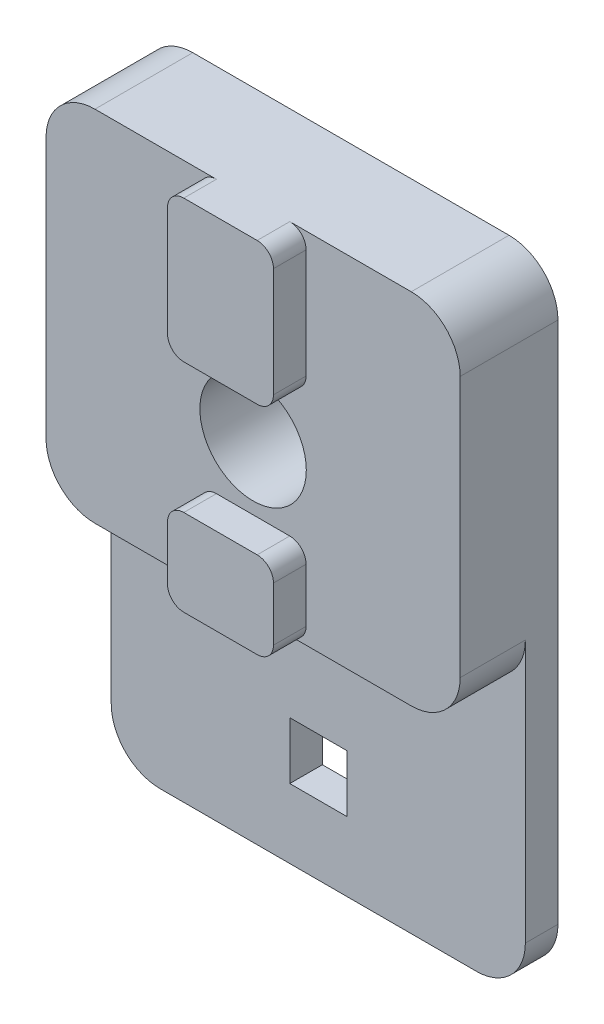
ISO-10303-21;
HEADER;
FILE_DESCRIPTION(('STEP AP214'),'2;1');
FILE_NAME('part.step','',(''),(''),'','','');
FILE_SCHEMA(('AUTOMOTIVE_DESIGN { 1 0 10303 214 1 1 1 1 }'));
ENDSEC;
DATA;
#1=APPLICATION_CONTEXT('core data for automotive mechanical design processes');
#2=APPLICATION_PROTOCOL_DEFINITION('international standard','automotive_design',2000,#1);
#3=PRODUCT_CONTEXT('',#1,'mechanical');
#4=PRODUCT('Part','Part','',(#3));
#5=PRODUCT_RELATED_PRODUCT_CATEGORY('part','',(#4));
#6=PRODUCT_DEFINITION_FORMATION('','',#4);
#7=PRODUCT_DEFINITION_CONTEXT('part definition',#1,'design');
#8=PRODUCT_DEFINITION('design','',#6,#7);
#9=PRODUCT_DEFINITION_SHAPE('','',#8);
#10=(LENGTH_UNIT() NAMED_UNIT(*) SI_UNIT(.MILLI.,.METRE.));
#11=(NAMED_UNIT(*) PLANE_ANGLE_UNIT() SI_UNIT($,.RADIAN.));
#12=(NAMED_UNIT(*) SI_UNIT($,.STERADIAN.) SOLID_ANGLE_UNIT());
#13=UNCERTAINTY_MEASURE_WITH_UNIT(LENGTH_MEASURE(1.E-05),#10,'distance_accuracy_value','');
#14=(GEOMETRIC_REPRESENTATION_CONTEXT(3) GLOBAL_UNCERTAINTY_ASSIGNED_CONTEXT((#13)) GLOBAL_UNIT_ASSIGNED_CONTEXT((#10,
#11,#12)) REPRESENTATION_CONTEXT('',''));
#15=CARTESIAN_POINT('',(0.,0.,0.));
#16=DIRECTION('',(0.,0.,1.));
#17=DIRECTION('',(1.,0.,0.));
#18=AXIS2_PLACEMENT_3D('',#15,#16,#17);
#19=CARTESIAN_POINT('',(0.,0.,6.));
#20=DIRECTION('',(0.,0.,1.));
#21=DIRECTION('',(1.,0.,0.));
#22=AXIS2_PLACEMENT_3D('',#19,#20,#21);
#23=PLANE('',#22);
#24=CARTESIAN_POINT('',(0.,19.4,6.));
#25=DIRECTION('',(0.,0.,1.));
#26=DIRECTION('',(1.,0.,0.));
#27=AXIS2_PLACEMENT_3D('',#24,#25,#26);
#28=CIRCLE('',#27,3.2639);
#29=CARTESIAN_POINT('',(3.2639,19.4,6.));
#30=VERTEX_POINT('',#29);
#31=EDGE_CURVE('E479',#30,#30,#28,.T.);
#32=ORIENTED_EDGE('',*,*,#31,.F.);
#33=EDGE_LOOP('',(#32));
#34=FACE_BOUND('',#33,.T.);
#35=DIRECTION('',(0.,-1.,0.));
#36=VECTOR('',#35,1.);
#37=CARTESIAN_POINT('',(-12.7,0.,6.));
#38=LINE('',#37,#36);
#39=CARTESIAN_POINT('',(-12.7,29.1,6.));
#40=VERTEX_POINT('',#39);
#41=CARTESIAN_POINT('',(-12.7,13.1,6.));
#42=VERTEX_POINT('',#41);
#43=EDGE_CURVE('E495',#40,#42,#38,.T.);
#44=ORIENTED_EDGE('',*,*,#43,.T.);
#45=CARTESIAN_POINT('',(-9.7,13.1,6.));
#46=DIRECTION('',(0.,0.,1.));
#47=DIRECTION('',(1.,0.,0.));
#48=AXIS2_PLACEMENT_3D('',#45,#46,#47);
#49=CIRCLE('',#48,3.);
#50=CARTESIAN_POINT('',(-9.7,10.1,6.));
#51=VERTEX_POINT('',#50);
#52=EDGE_CURVE('E323',#42,#51,#49,.T.);
#53=ORIENTED_EDGE('',*,*,#52,.T.);
#54=DIRECTION('',(1.,0.,0.));
#55=VECTOR('',#54,1.);
#56=CARTESIAN_POINT('',(0.,10.1,6.));
#57=LINE('',#56,#55);
#58=CARTESIAN_POINT('',(-2.25,10.1,6.));
#59=VERTEX_POINT('',#58);
#60=EDGE_CURVE('E57',#51,#59,#57,.T.);
#61=ORIENTED_EDGE('',*,*,#60,.T.);
#62=CARTESIAN_POINT('',(-2.25,11.1,6.));
#63=DIRECTION('',(0.,0.,1.));
#64=DIRECTION('',(1.,0.,0.));
#65=AXIS2_PLACEMENT_3D('',#62,#63,#64);
#66=CIRCLE('',#65,1.);
#67=CARTESIAN_POINT('',(-3.25,11.1,6.));
#68=VERTEX_POINT('',#67);
#69=EDGE_CURVE('E11',#59,#68,#66,.F.);
#70=ORIENTED_EDGE('',*,*,#69,.T.);
#71=DIRECTION('',(0.,-1.,0.));
#72=VECTOR('',#71,1.);
#73=CARTESIAN_POINT('',(-3.25,0.,6.));
#74=LINE('',#73,#72);
#75=CARTESIAN_POINT('',(-3.25,14.4,6.));
#76=VERTEX_POINT('',#75);
#77=EDGE_CURVE('E460',#76,#68,#74,.T.);
#78=ORIENTED_EDGE('',*,*,#77,.F.);
#79=CARTESIAN_POINT('',(-2.25,14.4,6.));
#80=DIRECTION('',(0.,0.,1.));
#81=DIRECTION('',(1.,0.,0.));
#82=AXIS2_PLACEMENT_3D('',#79,#80,#81);
#83=CIRCLE('',#82,1.);
#84=CARTESIAN_POINT('',(-2.25,15.4,6.));
#85=VERTEX_POINT('',#84);
#86=EDGE_CURVE('E427',#76,#85,#83,.F.);
#87=ORIENTED_EDGE('',*,*,#86,.T.);
#88=DIRECTION('',(1.,0.,0.));
#89=VECTOR('',#88,1.);
#90=CARTESIAN_POINT('',(0.,15.4,6.));
#91=LINE('',#90,#89);
#92=CARTESIAN_POINT('',(2.25,15.4,6.));
#93=VERTEX_POINT('',#92);
#94=EDGE_CURVE('E454',#85,#93,#91,.T.);
#95=ORIENTED_EDGE('',*,*,#94,.T.);
#96=CARTESIAN_POINT('',(2.25,14.4,6.));
#97=DIRECTION('',(0.,0.,1.));
#98=DIRECTION('',(1.,0.,0.));
#99=AXIS2_PLACEMENT_3D('',#96,#97,#98);
#100=CIRCLE('',#99,1.);
#101=CARTESIAN_POINT('',(3.25,14.4,6.));
#102=VERTEX_POINT('',#101);
#103=EDGE_CURVE('E425',#93,#102,#100,.F.);
#104=ORIENTED_EDGE('',*,*,#103,.T.);
#105=DIRECTION('',(0.,-1.,0.));
#106=VECTOR('',#105,1.);
#107=CARTESIAN_POINT('',(3.25,0.,6.));
#108=LINE('',#107,#106);
#109=CARTESIAN_POINT('',(3.25,11.1,6.));
#110=VERTEX_POINT('',#109);
#111=EDGE_CURVE('E433',#102,#110,#108,.T.);
#112=ORIENTED_EDGE('',*,*,#111,.T.);
#113=CARTESIAN_POINT('',(2.25,11.1,6.));
#114=DIRECTION('',(0.,0.,1.));
#115=DIRECTION('',(1.,0.,0.));
#116=AXIS2_PLACEMENT_3D('',#113,#114,#115);
#117=CIRCLE('',#116,1.);
#118=CARTESIAN_POINT('',(2.25,10.1,6.));
#119=VERTEX_POINT('',#118);
#120=EDGE_CURVE('E43',#110,#119,#117,.F.);
#121=ORIENTED_EDGE('',*,*,#120,.T.);
#122=CARTESIAN_POINT('',(9.7,10.1,6.));
#123=VERTEX_POINT('',#122);
#124=EDGE_CURVE('E50',#119,#123,#57,.T.);
#125=ORIENTED_EDGE('',*,*,#124,.T.);
#126=CARTESIAN_POINT('',(9.7,13.1,6.));
#127=DIRECTION('',(0.,0.,1.));
#128=DIRECTION('',(1.,0.,0.));
#129=AXIS2_PLACEMENT_3D('',#126,#127,#128);
#130=CIRCLE('',#129,3.);
#131=CARTESIAN_POINT('',(12.7,13.1,6.));
#132=VERTEX_POINT('',#131);
#133=EDGE_CURVE('E321',#123,#132,#130,.T.);
#134=ORIENTED_EDGE('',*,*,#133,.T.);
#135=DIRECTION('',(0.,-1.,0.));
#136=VECTOR('',#135,1.);
#137=CARTESIAN_POINT('',(12.7,0.,6.));
#138=LINE('',#137,#136);
#139=CARTESIAN_POINT('',(12.7,29.1,6.));
#140=VERTEX_POINT('',#139);
#141=EDGE_CURVE('E489',#140,#132,#138,.T.);
#142=ORIENTED_EDGE('',*,*,#141,.F.);
#143=CARTESIAN_POINT('',(9.7,29.1,6.));
#144=DIRECTION('',(0.,0.,1.));
#145=DIRECTION('',(1.,0.,0.));
#146=AXIS2_PLACEMENT_3D('',#143,#144,#145);
#147=CIRCLE('',#146,3.);
#148=CARTESIAN_POINT('',(9.7,32.1,6.));
#149=VERTEX_POINT('',#148);
#150=EDGE_CURVE('E319',#140,#149,#147,.T.);
#151=ORIENTED_EDGE('',*,*,#150,.T.);
#152=DIRECTION('',(1.,0.,0.));
#153=VECTOR('',#152,1.);
#154=CARTESIAN_POINT('',(0.,32.1,6.));
#155=LINE('',#154,#153);
#156=CARTESIAN_POINT('',(2.25,32.1,6.));
#157=VERTEX_POINT('',#156);
#158=EDGE_CURVE('E492',#157,#149,#155,.T.);
#159=ORIENTED_EDGE('',*,*,#158,.F.);
#160=CARTESIAN_POINT('',(2.25,31.1,6.));
#161=DIRECTION('',(0.,0.,1.));
#162=DIRECTION('',(1.,0.,0.));
#163=AXIS2_PLACEMENT_3D('',#160,#161,#162);
#164=CIRCLE('',#163,1.);
#165=CARTESIAN_POINT('',(3.25,31.1,6.));
#166=VERTEX_POINT('',#165);
#167=EDGE_CURVE('E416',#157,#166,#164,.F.);
#168=ORIENTED_EDGE('',*,*,#167,.T.);
#169=DIRECTION('',(0.,-1.,0.));
#170=VECTOR('',#169,1.);
#171=CARTESIAN_POINT('',(3.25,0.,6.));
#172=LINE('',#171,#170);
#173=CARTESIAN_POINT('',(3.25,24.4,6.));
#174=VERTEX_POINT('',#173);
#175=EDGE_CURVE('E470',#166,#174,#172,.T.);
#176=ORIENTED_EDGE('',*,*,#175,.T.);
#177=CARTESIAN_POINT('',(2.25,24.4,6.));
#178=DIRECTION('',(0.,0.,1.));
#179=DIRECTION('',(1.,0.,0.));
#180=AXIS2_PLACEMENT_3D('',#177,#178,#179);
#181=CIRCLE('',#180,1.);
#182=CARTESIAN_POINT('',(2.25,23.4,6.));
#183=VERTEX_POINT('',#182);
#184=EDGE_CURVE('E423',#174,#183,#181,.F.);
#185=ORIENTED_EDGE('',*,*,#184,.T.);
#186=DIRECTION('',(1.,0.,0.));
#187=VECTOR('',#186,1.);
#188=CARTESIAN_POINT('',(0.,23.4,6.));
#189=LINE('',#188,#187);
#190=CARTESIAN_POINT('',(-2.25,23.4,6.));
#191=VERTEX_POINT('',#190);
#192=EDGE_CURVE('E482',#191,#183,#189,.T.);
#193=ORIENTED_EDGE('',*,*,#192,.F.);
#194=CARTESIAN_POINT('',(-2.25,24.4,6.));
#195=DIRECTION('',(0.,0.,1.));
#196=DIRECTION('',(1.,0.,0.));
#197=AXIS2_PLACEMENT_3D('',#194,#195,#196);
#198=CIRCLE('',#197,1.);
#199=CARTESIAN_POINT('',(-3.25,24.4,6.));
#200=VERTEX_POINT('',#199);
#201=EDGE_CURVE('E421',#191,#200,#198,.F.);
#202=ORIENTED_EDGE('',*,*,#201,.T.);
#203=DIRECTION('',(0.,-1.,0.));
#204=VECTOR('',#203,1.);
#205=CARTESIAN_POINT('',(-3.25,0.,6.));
#206=LINE('',#205,#204);
#207=CARTESIAN_POINT('',(-3.25,31.1,6.));
#208=VERTEX_POINT('',#207);
#209=EDGE_CURVE('E459',#208,#200,#206,.T.);
#210=ORIENTED_EDGE('',*,*,#209,.F.);
#211=CARTESIAN_POINT('',(-2.25,31.1,6.));
#212=DIRECTION('',(0.,0.,1.));
#213=DIRECTION('',(1.,0.,0.));
#214=AXIS2_PLACEMENT_3D('',#211,#212,#213);
#215=CIRCLE('',#214,1.);
#216=CARTESIAN_POINT('',(-2.25,32.1,6.));
#217=VERTEX_POINT('',#216);
#218=EDGE_CURVE('E418',#208,#217,#215,.F.);
#219=ORIENTED_EDGE('',*,*,#218,.T.);
#220=CARTESIAN_POINT('',(-9.7,32.1,6.));
#221=VERTEX_POINT('',#220);
#222=EDGE_CURVE('E493',#221,#217,#155,.T.);
#223=ORIENTED_EDGE('',*,*,#222,.F.);
#224=CARTESIAN_POINT('',(-9.7,29.1,6.));
#225=DIRECTION('',(0.,0.,1.));
#226=DIRECTION('',(1.,0.,0.));
#227=AXIS2_PLACEMENT_3D('',#224,#225,#226);
#228=CIRCLE('',#227,3.);
#229=EDGE_CURVE('E317',#221,#40,#228,.T.);
#230=ORIENTED_EDGE('',*,*,#229,.T.);
#231=EDGE_LOOP('',(#44,#53,#61,#70,#78,#87,#95,#104,#112,#121,#125,#134,#142,#151,#159,#168,
#176,#185,#193,#202,#210,#219,#223,#230));
#232=FACE_BOUND('',#231,.T.);
#233=ADVANCED_FACE('F35',(#34,#232),#23,.T.);
#234=CARTESIAN_POINT('',(0.,0.,2.));
#235=DIRECTION('',(0.,0.,1.));
#236=DIRECTION('',(1.,0.,0.));
#237=AXIS2_PLACEMENT_3D('',#234,#235,#236);
#238=PLANE('',#237);
#239=DIRECTION('',(0.,-1.,0.));
#240=VECTOR('',#239,1.);
#241=CARTESIAN_POINT('',(-1.75,0.,2.));
#242=LINE('',#241,#240);
#243=CARTESIAN_POINT('',(-1.75,1.75,2.));
#244=VERTEX_POINT('',#243);
#245=CARTESIAN_POINT('',(-1.75,-1.75,2.));
#246=VERTEX_POINT('',#245);
#247=EDGE_CURVE('E246',#244,#246,#242,.T.);
#248=ORIENTED_EDGE('',*,*,#247,.F.);
#249=DIRECTION('',(-1.,0.,0.));
#250=VECTOR('',#249,1.);
#251=CARTESIAN_POINT('',(0.,1.75,2.));
#252=LINE('',#251,#250);
#253=CARTESIAN_POINT('',(1.75,1.75,2.));
#254=VERTEX_POINT('',#253);
#255=EDGE_CURVE('E261',#254,#244,#252,.T.);
#256=ORIENTED_EDGE('',*,*,#255,.F.);
#257=DIRECTION('',(0.,-1.,0.));
#258=VECTOR('',#257,1.);
#259=CARTESIAN_POINT('',(1.75,0.,2.));
#260=LINE('',#259,#258);
#261=CARTESIAN_POINT('',(1.75,-1.75,2.));
#262=VERTEX_POINT('',#261);
#263=EDGE_CURVE('E268',#254,#262,#260,.T.);
#264=ORIENTED_EDGE('',*,*,#263,.T.);
#265=DIRECTION('',(-1.,0.,0.));
#266=VECTOR('',#265,1.);
#267=CARTESIAN_POINT('',(0.,-1.75,2.));
#268=LINE('',#267,#266);
#269=EDGE_CURVE('E262',#262,#246,#268,.T.);
#270=ORIENTED_EDGE('',*,*,#269,.T.);
#271=EDGE_LOOP('',(#248,#256,#264,#270));
#272=FACE_BOUND('',#271,.T.);
#273=DIRECTION('',(0.,-1.,0.));
#274=VECTOR('',#273,1.);
#275=CARTESIAN_POINT('',(-12.7,0.,2.));
#276=LINE('',#275,#274);
#277=CARTESIAN_POINT('',(-12.7,13.1,2.));
#278=VERTEX_POINT('',#277);
#279=CARTESIAN_POINT('',(-12.7,-3.,2.));
#280=VERTEX_POINT('',#279);
#281=EDGE_CURVE('E502',#278,#280,#276,.T.);
#282=ORIENTED_EDGE('',*,*,#281,.T.);
#283=CARTESIAN_POINT('',(-9.69999999999999,-3.,2.));
#284=DIRECTION('',(0.,0.,1.));
#285=DIRECTION('',(1.,0.,0.));
#286=AXIS2_PLACEMENT_3D('',#283,#284,#285);
#287=CIRCLE('',#286,3.);
#288=CARTESIAN_POINT('',(-9.69999999999999,-6.,2.));
#289=VERTEX_POINT('',#288);
#290=EDGE_CURVE('E353',#280,#289,#287,.T.);
#291=ORIENTED_EDGE('',*,*,#290,.T.);
#292=DIRECTION('',(1.,0.,0.));
#293=VECTOR('',#292,1.);
#294=CARTESIAN_POINT('',(0.,-6.,2.));
#295=LINE('',#294,#293);
#296=CARTESIAN_POINT('',(9.69999999999999,-6.,2.));
#297=VERTEX_POINT('',#296);
#298=EDGE_CURVE('E264',#289,#297,#295,.T.);
#299=ORIENTED_EDGE('',*,*,#298,.T.);
#300=CARTESIAN_POINT('',(9.69999999999999,-3.,2.));
#301=DIRECTION('',(0.,0.,1.));
#302=DIRECTION('',(1.,0.,0.));
#303=AXIS2_PLACEMENT_3D('',#300,#301,#302);
#304=CIRCLE('',#303,3.);
#305=CARTESIAN_POINT('',(12.7,-3.,2.));
#306=VERTEX_POINT('',#305);
#307=EDGE_CURVE('E351',#297,#306,#304,.T.);
#308=ORIENTED_EDGE('',*,*,#307,.T.);
#309=DIRECTION('',(0.,-1.,0.));
#310=VECTOR('',#309,1.);
#311=CARTESIAN_POINT('',(12.7,0.,2.));
#312=LINE('',#311,#310);
#313=CARTESIAN_POINT('',(12.7,13.1,2.));
#314=VERTEX_POINT('',#313);
#315=EDGE_CURVE('E300',#314,#306,#312,.T.);
#316=ORIENTED_EDGE('',*,*,#315,.F.);
#317=CARTESIAN_POINT('',(9.7,13.1,2.));
#318=DIRECTION('',(0.,0.,1.));
#319=DIRECTION('',(1.,0.,0.));
#320=AXIS2_PLACEMENT_3D('',#317,#318,#319);
#321=CIRCLE('',#320,3.);
#322=CARTESIAN_POINT('',(9.7,10.1,2.));
#323=VERTEX_POINT('',#322);
#324=EDGE_CURVE('E358',#314,#323,#321,.F.);
#325=ORIENTED_EDGE('',*,*,#324,.T.);
#326=DIRECTION('',(-1.,0.,0.));
#327=VECTOR('',#326,1.);
#328=CARTESIAN_POINT('',(0.,10.1,2.));
#329=LINE('',#328,#327);
#330=CARTESIAN_POINT('',(-9.7,10.1,2.));
#331=VERTEX_POINT('',#330);
#332=EDGE_CURVE('E279',#323,#331,#329,.T.);
#333=ORIENTED_EDGE('',*,*,#332,.T.);
#334=CARTESIAN_POINT('',(-9.7,13.1,2.));
#335=DIRECTION('',(0.,0.,1.));
#336=DIRECTION('',(1.,0.,0.));
#337=AXIS2_PLACEMENT_3D('',#334,#335,#336);
#338=CIRCLE('',#337,3.);
#339=EDGE_CURVE('E355',#331,#278,#338,.F.);
#340=ORIENTED_EDGE('',*,*,#339,.T.);
#341=EDGE_LOOP('',(#282,#291,#299,#308,#316,#325,#333,#340));
#342=FACE_BOUND('',#341,.T.);
#343=ADVANCED_FACE('F258',(#272,#342),#238,.T.);
#344=CARTESIAN_POINT('',(-1.75,0.,2.));
#345=DIRECTION('',(1.,0.,0.));
#346=DIRECTION('',(0.,0.,-1.));
#347=AXIS2_PLACEMENT_3D('',#344,#345,#346);
#348=PLANE('',#347);
#349=DIRECTION('',(0.,-1.,0.));
#350=VECTOR('',#349,1.);
#351=CARTESIAN_POINT('',(-1.75,0.,0.));
#352=LINE('',#351,#350);
#353=CARTESIAN_POINT('',(-1.75,1.75,0.));
#354=VERTEX_POINT('',#353);
#355=CARTESIAN_POINT('',(-1.75,-1.75,0.));
#356=VERTEX_POINT('',#355);
#357=EDGE_CURVE('E248',#354,#356,#352,.T.);
#358=ORIENTED_EDGE('',*,*,#357,.F.);
#359=DIRECTION('',(0.,0.,-1.));
#360=VECTOR('',#359,1.);
#361=CARTESIAN_POINT('',(-1.75,1.75,2.));
#362=LINE('',#361,#360);
#363=EDGE_CURVE('E243',#244,#354,#362,.T.);
#364=ORIENTED_EDGE('',*,*,#363,.F.);
#365=ORIENTED_EDGE('',*,*,#247,.T.);
#366=DIRECTION('',(0.,0.,-1.));
#367=VECTOR('',#366,1.);
#368=CARTESIAN_POINT('',(-1.75,-1.75,2.));
#369=LINE('',#368,#367);
#370=EDGE_CURVE('E274',#246,#356,#369,.T.);
#371=ORIENTED_EDGE('',*,*,#370,.T.);
#372=EDGE_LOOP('',(#358,#364,#365,#371));
#373=FACE_BOUND('',#372,.T.);
#374=ADVANCED_FACE('F245',(#373),#348,.T.);
#375=CARTESIAN_POINT('',(0.,1.75,2.));
#376=DIRECTION('',(0.,-1.,0.));
#377=DIRECTION('',(0.,0.,-1.));
#378=AXIS2_PLACEMENT_3D('',#375,#376,#377);
#379=PLANE('',#378);
#380=DIRECTION('',(-1.,0.,0.));
#381=VECTOR('',#380,1.);
#382=CARTESIAN_POINT('',(0.,1.75,0.));
#383=LINE('',#382,#381);
#384=CARTESIAN_POINT('',(1.75,1.75,0.));
#385=VERTEX_POINT('',#384);
#386=EDGE_CURVE('E292',#385,#354,#383,.T.);
#387=ORIENTED_EDGE('',*,*,#386,.F.);
#388=DIRECTION('',(0.,0.,-1.));
#389=VECTOR('',#388,1.);
#390=CARTESIAN_POINT('',(1.75,1.75,2.));
#391=LINE('',#390,#389);
#392=EDGE_CURVE('E254',#254,#385,#391,.T.);
#393=ORIENTED_EDGE('',*,*,#392,.F.);
#394=ORIENTED_EDGE('',*,*,#255,.T.);
#395=ORIENTED_EDGE('',*,*,#363,.T.);
#396=EDGE_LOOP('',(#387,#393,#394,#395));
#397=FACE_BOUND('',#396,.T.);
#398=ADVANCED_FACE('F266',(#397),#379,.T.);
#399=CARTESIAN_POINT('',(1.75,0.,2.));
#400=DIRECTION('',(1.,0.,0.));
#401=DIRECTION('',(0.,0.,-1.));
#402=AXIS2_PLACEMENT_3D('',#399,#400,#401);
#403=PLANE('',#402);
#404=DIRECTION('',(0.,-1.,0.));
#405=VECTOR('',#404,1.);
#406=CARTESIAN_POINT('',(1.75,0.,0.));
#407=LINE('',#406,#405);
#408=CARTESIAN_POINT('',(1.75,-1.75,0.));
#409=VERTEX_POINT('',#408);
#410=EDGE_CURVE('E294',#385,#409,#407,.T.);
#411=ORIENTED_EDGE('',*,*,#410,.T.);
#412=DIRECTION('',(0.,0.,-1.));
#413=VECTOR('',#412,1.);
#414=CARTESIAN_POINT('',(1.75,-1.75,2.));
#415=LINE('',#414,#413);
#416=EDGE_CURVE('E302',#262,#409,#415,.T.);
#417=ORIENTED_EDGE('',*,*,#416,.F.);
#418=ORIENTED_EDGE('',*,*,#263,.F.);
#419=ORIENTED_EDGE('',*,*,#392,.T.);
#420=EDGE_LOOP('',(#411,#417,#418,#419));
#421=FACE_BOUND('',#420,.T.);
#422=ADVANCED_FACE('F612',(#421),#403,.F.);
#423=CARTESIAN_POINT('',(12.7,0.,2.));
#424=DIRECTION('',(1.,0.,0.));
#425=DIRECTION('',(0.,1.,0.));
#426=AXIS2_PLACEMENT_3D('',#423,#424,#425);
#427=PLANE('',#426);
#428=ORIENTED_EDGE('',*,*,#141,.T.);
#429=DIRECTION('',(0.,0.,-1.));
#430=VECTOR('',#429,1.);
#431=CARTESIAN_POINT('',(12.7,13.1,2.));
#432=LINE('',#431,#430);
#433=EDGE_CURVE('E330',#132,#314,#432,.T.);
#434=ORIENTED_EDGE('',*,*,#433,.T.);
#435=ORIENTED_EDGE('',*,*,#315,.T.);
#436=DIRECTION('',(0.,0.,-1.));
#437=VECTOR('',#436,1.);
#438=CARTESIAN_POINT('',(12.7,-3.,0.));
#439=LINE('',#438,#437);
#440=CARTESIAN_POINT('',(12.7,-3.,0.));
#441=VERTEX_POINT('',#440);
#442=EDGE_CURVE('E325',#306,#441,#439,.T.);
#443=ORIENTED_EDGE('',*,*,#442,.T.);
#444=DIRECTION('',(0.,-1.,0.));
#445=VECTOR('',#444,1.);
#446=CARTESIAN_POINT('',(12.7,0.,0.));
#447=LINE('',#446,#445);
#448=CARTESIAN_POINT('',(12.7,29.1,0.));
#449=VERTEX_POINT('',#448);
#450=EDGE_CURVE('E278',#449,#441,#447,.T.);
#451=ORIENTED_EDGE('',*,*,#450,.F.);
#452=DIRECTION('',(0.,0.,-1.));
#453=VECTOR('',#452,1.);
#454=CARTESIAN_POINT('',(12.7,29.1,2.));
#455=LINE('',#454,#453);
#456=EDGE_CURVE('E328',#449,#140,#455,.F.);
#457=ORIENTED_EDGE('',*,*,#456,.T.);
#458=EDGE_LOOP('',(#428,#434,#435,#443,#451,#457));
#459=FACE_BOUND('',#458,.T.);
#460=ADVANCED_FACE('F516',(#459),#427,.T.);
#461=CARTESIAN_POINT('',(0.,32.1,2.));
#462=DIRECTION('',(0.,1.,0.));
#463=DIRECTION('',(0.,0.,1.));
#464=AXIS2_PLACEMENT_3D('',#461,#462,#463);
#465=PLANE('',#464);
#466=DIRECTION('',(-1.,0.,0.));
#467=VECTOR('',#466,1.);
#468=CARTESIAN_POINT('',(0.,32.1,8.));
#469=LINE('',#468,#467);
#470=CARTESIAN_POINT('',(2.25,32.1,8.));
#471=VERTEX_POINT('',#470);
#472=CARTESIAN_POINT('',(-2.25,32.1,8.));
#473=VERTEX_POINT('',#472);
#474=EDGE_CURVE('E466',#471,#473,#469,.T.);
#475=ORIENTED_EDGE('',*,*,#474,.F.);
#476=DIRECTION('',(0.,0.,-1.));
#477=VECTOR('',#476,1.);
#478=CARTESIAN_POINT('',(2.25,32.1,2.));
#479=LINE('',#478,#477);
#480=EDGE_CURVE('E362',#471,#157,#479,.T.);
#481=ORIENTED_EDGE('',*,*,#480,.T.);
#482=ORIENTED_EDGE('',*,*,#158,.T.);
#483=DIRECTION('',(0.,0.,-1.));
#484=VECTOR('',#483,1.);
#485=CARTESIAN_POINT('',(9.7,32.1,2.));
#486=LINE('',#485,#484);
#487=CARTESIAN_POINT('',(9.7,32.1,0.));
#488=VERTEX_POINT('',#487);
#489=EDGE_CURVE('E335',#149,#488,#486,.T.);
#490=ORIENTED_EDGE('',*,*,#489,.T.);
#491=DIRECTION('',(1.,0.,0.));
#492=VECTOR('',#491,1.);
#493=CARTESIAN_POINT('',(0.,32.1,0.));
#494=LINE('',#493,#492);
#495=CARTESIAN_POINT('',(-9.7,32.1,0.));
#496=VERTEX_POINT('',#495);
#497=EDGE_CURVE('E282',#496,#488,#494,.T.);
#498=ORIENTED_EDGE('',*,*,#497,.F.);
#499=DIRECTION('',(0.,0.,-1.));
#500=VECTOR('',#499,1.);
#501=CARTESIAN_POINT('',(-9.7,32.1,6.));
#502=LINE('',#501,#500);
#503=EDGE_CURVE('E333',#496,#221,#502,.F.);
#504=ORIENTED_EDGE('',*,*,#503,.T.);
#505=ORIENTED_EDGE('',*,*,#222,.T.);
#506=DIRECTION('',(0.,0.,-1.));
#507=VECTOR('',#506,1.);
#508=CARTESIAN_POINT('',(-2.25,32.1,8.));
#509=LINE('',#508,#507);
#510=EDGE_CURVE('E360',#217,#473,#509,.F.);
#511=ORIENTED_EDGE('',*,*,#510,.T.);
#512=EDGE_LOOP('',(#475,#481,#482,#490,#498,#504,#505,#511));
#513=FACE_BOUND('',#512,.T.);
#514=ADVANCED_FACE('F530',(#513),#465,.T.);
#515=CARTESIAN_POINT('',(-12.7,0.,2.));
#516=DIRECTION('',(1.,0.,0.));
#517=DIRECTION('',(0.,1.,0.));
#518=AXIS2_PLACEMENT_3D('',#515,#516,#517);
#519=PLANE('',#518);
#520=ORIENTED_EDGE('',*,*,#281,.F.);
#521=DIRECTION('',(0.,0.,-1.));
#522=VECTOR('',#521,1.);
#523=CARTESIAN_POINT('',(-12.7,13.1,2.));
#524=LINE('',#523,#522);
#525=EDGE_CURVE('E315',#278,#42,#524,.F.);
#526=ORIENTED_EDGE('',*,*,#525,.T.);
#527=ORIENTED_EDGE('',*,*,#43,.F.);
#528=DIRECTION('',(0.,0.,-1.));
#529=VECTOR('',#528,1.);
#530=CARTESIAN_POINT('',(-12.7,29.1,0.));
#531=LINE('',#530,#529);
#532=CARTESIAN_POINT('',(-12.7,29.1,0.));
#533=VERTEX_POINT('',#532);
#534=EDGE_CURVE('E312',#40,#533,#531,.T.);
#535=ORIENTED_EDGE('',*,*,#534,.T.);
#536=DIRECTION('',(0.,-1.,0.));
#537=VECTOR('',#536,1.);
#538=CARTESIAN_POINT('',(-12.7,0.,0.));
#539=LINE('',#538,#537);
#540=CARTESIAN_POINT('',(-12.7,-3.,0.));
#541=VERTEX_POINT('',#540);
#542=EDGE_CURVE('E285',#533,#541,#539,.T.);
#543=ORIENTED_EDGE('',*,*,#542,.T.);
#544=DIRECTION('',(0.,0.,-1.));
#545=VECTOR('',#544,1.);
#546=CARTESIAN_POINT('',(-12.7,-3.,2.));
#547=LINE('',#546,#545);
#548=EDGE_CURVE('E310',#541,#280,#547,.F.);
#549=ORIENTED_EDGE('',*,*,#548,.T.);
#550=EDGE_LOOP('',(#520,#526,#527,#535,#543,#549));
#551=FACE_BOUND('',#550,.T.);
#552=ADVANCED_FACE('F576',(#551),#519,.F.);
#553=CARTESIAN_POINT('',(0.,-6.,2.));
#554=DIRECTION('',(0.,1.,0.));
#555=DIRECTION('',(0.,0.,1.));
#556=AXIS2_PLACEMENT_3D('',#553,#554,#555);
#557=PLANE('',#556);
#558=ORIENTED_EDGE('',*,*,#298,.F.);
#559=DIRECTION('',(0.,0.,-1.));
#560=VECTOR('',#559,1.);
#561=CARTESIAN_POINT('',(-9.69999999999999,-6.,2.));
#562=LINE('',#561,#560);
#563=CARTESIAN_POINT('',(-9.69999999999999,-6.,0.));
#564=VERTEX_POINT('',#563);
#565=EDGE_CURVE('E348',#289,#564,#562,.T.);
#566=ORIENTED_EDGE('',*,*,#565,.T.);
#567=DIRECTION('',(1.,0.,0.));
#568=VECTOR('',#567,1.);
#569=CARTESIAN_POINT('',(0.,-6.,0.));
#570=LINE('',#569,#568);
#571=CARTESIAN_POINT('',(9.69999999999999,-6.,0.));
#572=VERTEX_POINT('',#571);
#573=EDGE_CURVE('E288',#564,#572,#570,.T.);
#574=ORIENTED_EDGE('',*,*,#573,.T.);
#575=DIRECTION('',(0.,0.,-1.));
#576=VECTOR('',#575,1.);
#577=CARTESIAN_POINT('',(9.69999999999999,-6.,2.));
#578=LINE('',#577,#576);
#579=EDGE_CURVE('E346',#572,#297,#578,.F.);
#580=ORIENTED_EDGE('',*,*,#579,.T.);
#581=EDGE_LOOP('',(#558,#566,#574,#580));
#582=FACE_BOUND('',#581,.T.);
#583=ADVANCED_FACE('F580',(#582),#557,.F.);
#584=CARTESIAN_POINT('',(0.,19.4,2.));
#585=DIRECTION('',(0.,0.,-1.));
#586=DIRECTION('',(-1.,0.,0.));
#587=AXIS2_PLACEMENT_3D('',#584,#585,#586);
#588=CYLINDRICAL_SURFACE('',#587,3.2639);
#589=CARTESIAN_POINT('',(0.,19.4,0.));
#590=DIRECTION('',(0.,0.,1.));
#591=DIRECTION('',(1.,0.,0.));
#592=AXIS2_PLACEMENT_3D('',#589,#590,#591);
#593=CIRCLE('',#592,3.2639);
#594=CARTESIAN_POINT('',(3.2639,19.4,0.));
#595=VERTEX_POINT('',#594);
#596=EDGE_CURVE('E275',#595,#595,#593,.T.);
#597=ORIENTED_EDGE('',*,*,#596,.F.);
#598=EDGE_LOOP('',(#597));
#599=FACE_BOUND('',#598,.T.);
#600=ORIENTED_EDGE('',*,*,#31,.T.);
#601=EDGE_LOOP('',(#600));
#602=FACE_BOUND('',#601,.T.);
#603=ADVANCED_FACE('F582',(#599,#602),#588,.F.);
#604=CARTESIAN_POINT('',(0.,-1.75,2.));
#605=DIRECTION('',(0.,-1.,0.));
#606=DIRECTION('',(0.,0.,-1.));
#607=AXIS2_PLACEMENT_3D('',#604,#605,#606);
#608=PLANE('',#607);
#609=DIRECTION('',(-1.,0.,0.));
#610=VECTOR('',#609,1.);
#611=CARTESIAN_POINT('',(0.,-1.75,0.));
#612=LINE('',#611,#610);
#613=EDGE_CURVE('E297',#409,#356,#612,.T.);
#614=ORIENTED_EDGE('',*,*,#613,.T.);
#615=ORIENTED_EDGE('',*,*,#370,.F.);
#616=ORIENTED_EDGE('',*,*,#269,.F.);
#617=ORIENTED_EDGE('',*,*,#416,.T.);
#618=EDGE_LOOP('',(#614,#615,#616,#617));
#619=FACE_BOUND('',#618,.T.);
#620=ADVANCED_FACE('F588',(#619),#608,.F.);
#621=CARTESIAN_POINT('',(0.,0.,0.));
#622=DIRECTION('',(0.,0.,1.));
#623=DIRECTION('',(1.,0.,0.));
#624=AXIS2_PLACEMENT_3D('',#621,#622,#623);
#625=PLANE('',#624);
#626=ORIENTED_EDGE('',*,*,#596,.T.);
#627=EDGE_LOOP('',(#626));
#628=FACE_BOUND('',#627,.T.);
#629=ORIENTED_EDGE('',*,*,#497,.T.);
#630=CARTESIAN_POINT('',(9.7,29.1,0.));
#631=DIRECTION('',(0.,0.,1.));
#632=DIRECTION('',(1.,0.,0.));
#633=AXIS2_PLACEMENT_3D('',#630,#631,#632);
#634=CIRCLE('',#633,3.);
#635=EDGE_CURVE('E344',#488,#449,#634,.F.);
#636=ORIENTED_EDGE('',*,*,#635,.T.);
#637=ORIENTED_EDGE('',*,*,#450,.T.);
#638=CARTESIAN_POINT('',(9.69999999999999,-3.,0.));
#639=DIRECTION('',(0.,0.,1.));
#640=DIRECTION('',(1.,0.,0.));
#641=AXIS2_PLACEMENT_3D('',#638,#639,#640);
#642=CIRCLE('',#641,3.);
#643=EDGE_CURVE('E338',#441,#572,#642,.F.);
#644=ORIENTED_EDGE('',*,*,#643,.T.);
#645=ORIENTED_EDGE('',*,*,#573,.F.);
#646=CARTESIAN_POINT('',(-9.69999999999999,-3.,0.));
#647=DIRECTION('',(0.,0.,1.));
#648=DIRECTION('',(1.,0.,0.));
#649=AXIS2_PLACEMENT_3D('',#646,#647,#648);
#650=CIRCLE('',#649,3.);
#651=EDGE_CURVE('E340',#564,#541,#650,.F.);
#652=ORIENTED_EDGE('',*,*,#651,.T.);
#653=ORIENTED_EDGE('',*,*,#542,.F.);
#654=CARTESIAN_POINT('',(-9.7,29.1,0.));
#655=DIRECTION('',(0.,0.,1.));
#656=DIRECTION('',(1.,0.,0.));
#657=AXIS2_PLACEMENT_3D('',#654,#655,#656);
#658=CIRCLE('',#657,3.);
#659=EDGE_CURVE('E342',#533,#496,#658,.F.);
#660=ORIENTED_EDGE('',*,*,#659,.T.);
#661=EDGE_LOOP('',(#629,#636,#637,#644,#645,#652,#653,#660));
#662=FACE_BOUND('',#661,.T.);
#663=ORIENTED_EDGE('',*,*,#357,.T.);
#664=ORIENTED_EDGE('',*,*,#613,.F.);
#665=ORIENTED_EDGE('',*,*,#410,.F.);
#666=ORIENTED_EDGE('',*,*,#386,.T.);
#667=EDGE_LOOP('',(#663,#664,#665,#666));
#668=FACE_BOUND('',#667,.T.);
#669=ADVANCED_FACE('F519',(#628,#662,#668),#625,.F.);
#670=CARTESIAN_POINT('',(0.,10.1,6.));
#671=DIRECTION('',(0.,1.,0.));
#672=DIRECTION('',(0.,0.,1.));
#673=AXIS2_PLACEMENT_3D('',#670,#671,#672);
#674=PLANE('',#673);
#675=ORIENTED_EDGE('',*,*,#124,.F.);
#676=DIRECTION('',(0.,0.,-1.));
#677=VECTOR('',#676,1.);
#678=CARTESIAN_POINT('',(2.25,10.1,8.));
#679=LINE('',#678,#677);
#680=CARTESIAN_POINT('',(2.25,10.1,8.));
#681=VERTEX_POINT('',#680);
#682=EDGE_CURVE('E414',#119,#681,#679,.F.);
#683=ORIENTED_EDGE('',*,*,#682,.T.);
#684=DIRECTION('',(-1.,0.,0.));
#685=VECTOR('',#684,1.);
#686=CARTESIAN_POINT('',(0.,10.1,8.));
#687=LINE('',#686,#685);
#688=CARTESIAN_POINT('',(-2.25,10.1,8.));
#689=VERTEX_POINT('',#688);
#690=EDGE_CURVE('E441',#681,#689,#687,.T.);
#691=ORIENTED_EDGE('',*,*,#690,.T.);
#692=DIRECTION('',(0.,0.,-1.));
#693=VECTOR('',#692,1.);
#694=CARTESIAN_POINT('',(-2.25,10.1,6.));
#695=LINE('',#694,#693);
#696=EDGE_CURVE('E411',#689,#59,#695,.T.);
#697=ORIENTED_EDGE('',*,*,#696,.T.);
#698=ORIENTED_EDGE('',*,*,#60,.F.);
#699=DIRECTION('',(0.,0.,-1.));
#700=VECTOR('',#699,1.);
#701=CARTESIAN_POINT('',(-9.7,10.1,6.));
#702=LINE('',#701,#700);
#703=EDGE_CURVE('E307',#51,#331,#702,.T.);
#704=ORIENTED_EDGE('',*,*,#703,.T.);
#705=ORIENTED_EDGE('',*,*,#332,.F.);
#706=DIRECTION('',(0.,0.,-1.));
#707=VECTOR('',#706,1.);
#708=CARTESIAN_POINT('',(9.7,10.1,6.));
#709=LINE('',#708,#707);
#710=EDGE_CURVE('E253',#323,#123,#709,.F.);
#711=ORIENTED_EDGE('',*,*,#710,.T.);
#712=EDGE_LOOP('',(#675,#683,#691,#697,#698,#704,#705,#711));
#713=FACE_BOUND('',#712,.T.);
#714=ADVANCED_FACE('F440',(#713),#674,.F.);
#715=CARTESIAN_POINT('',(-3.25,0.,8.));
#716=DIRECTION('',(1.,0.,0.));
#717=DIRECTION('',(0.,1.,0.));
#718=AXIS2_PLACEMENT_3D('',#715,#716,#717);
#719=PLANE('',#718);
#720=DIRECTION('',(0.,-1.,0.));
#721=VECTOR('',#720,1.);
#722=CARTESIAN_POINT('',(-3.25,0.,8.));
#723=LINE('',#722,#721);
#724=CARTESIAN_POINT('',(-3.25,31.1,8.));
#725=VERTEX_POINT('',#724);
#726=CARTESIAN_POINT('',(-3.25,24.4,8.));
#727=VERTEX_POINT('',#726);
#728=EDGE_CURVE('E469',#725,#727,#723,.T.);
#729=ORIENTED_EDGE('',*,*,#728,.F.);
#730=DIRECTION('',(0.,0.,-1.));
#731=VECTOR('',#730,1.);
#732=CARTESIAN_POINT('',(-3.25,31.1,6.));
#733=LINE('',#732,#731);
#734=EDGE_CURVE('E380',#725,#208,#733,.T.);
#735=ORIENTED_EDGE('',*,*,#734,.T.);
#736=ORIENTED_EDGE('',*,*,#209,.T.);
#737=DIRECTION('',(0.,0.,-1.));
#738=VECTOR('',#737,1.);
#739=CARTESIAN_POINT('',(-3.25,24.4,8.));
#740=LINE('',#739,#738);
#741=EDGE_CURVE('E378',#200,#727,#740,.F.);
#742=ORIENTED_EDGE('',*,*,#741,.T.);
#743=EDGE_LOOP('',(#729,#735,#736,#742));
#744=FACE_BOUND('',#743,.T.);
#745=ADVANCED_FACE('F562',(#744),#719,.F.);
#746=CARTESIAN_POINT('',(0.,23.4,8.));
#747=DIRECTION('',(0.,1.,0.));
#748=DIRECTION('',(0.,0.,1.));
#749=AXIS2_PLACEMENT_3D('',#746,#747,#748);
#750=PLANE('',#749);
#751=DIRECTION('',(1.,0.,0.));
#752=VECTOR('',#751,1.);
#753=CARTESIAN_POINT('',(0.,23.4,8.));
#754=LINE('',#753,#752);
#755=CARTESIAN_POINT('',(-2.25,23.4,8.));
#756=VERTEX_POINT('',#755);
#757=CARTESIAN_POINT('',(2.25,23.4,8.));
#758=VERTEX_POINT('',#757);
#759=EDGE_CURVE('E473',#756,#758,#754,.T.);
#760=ORIENTED_EDGE('',*,*,#759,.F.);
#761=DIRECTION('',(0.,0.,-1.));
#762=VECTOR('',#761,1.);
#763=CARTESIAN_POINT('',(-2.25,23.4,8.));
#764=LINE('',#763,#762);
#765=EDGE_CURVE('E385',#756,#191,#764,.T.);
#766=ORIENTED_EDGE('',*,*,#765,.T.);
#767=ORIENTED_EDGE('',*,*,#192,.T.);
#768=DIRECTION('',(0.,0.,-1.));
#769=VECTOR('',#768,1.);
#770=CARTESIAN_POINT('',(2.25,23.4,8.));
#771=LINE('',#770,#769);
#772=EDGE_CURVE('E383',#183,#758,#771,.F.);
#773=ORIENTED_EDGE('',*,*,#772,.T.);
#774=EDGE_LOOP('',(#760,#766,#767,#773));
#775=FACE_BOUND('',#774,.T.);
#776=ADVANCED_FACE('F553',(#775),#750,.F.);
#777=CARTESIAN_POINT('',(3.25,0.,8.));
#778=DIRECTION('',(1.,0.,0.));
#779=DIRECTION('',(0.,1.,0.));
#780=AXIS2_PLACEMENT_3D('',#777,#778,#779);
#781=PLANE('',#780);
#782=ORIENTED_EDGE('',*,*,#175,.F.);
#783=DIRECTION('',(0.,0.,-1.));
#784=VECTOR('',#783,1.);
#785=CARTESIAN_POINT('',(3.25,31.1,8.));
#786=LINE('',#785,#784);
#787=CARTESIAN_POINT('',(3.25,31.1,8.));
#788=VERTEX_POINT('',#787);
#789=EDGE_CURVE('E368',#166,#788,#786,.F.);
#790=ORIENTED_EDGE('',*,*,#789,.T.);
#791=DIRECTION('',(0.,-1.,0.));
#792=VECTOR('',#791,1.);
#793=CARTESIAN_POINT('',(3.25,0.,8.));
#794=LINE('',#793,#792);
#795=CARTESIAN_POINT('',(3.25,24.4,8.));
#796=VERTEX_POINT('',#795);
#797=EDGE_CURVE('E476',#788,#796,#794,.T.);
#798=ORIENTED_EDGE('',*,*,#797,.T.);
#799=DIRECTION('',(0.,0.,-1.));
#800=VECTOR('',#799,1.);
#801=CARTESIAN_POINT('',(3.25,24.4,6.));
#802=LINE('',#801,#800);
#803=EDGE_CURVE('E365',#796,#174,#802,.T.);
#804=ORIENTED_EDGE('',*,*,#803,.T.);
#805=EDGE_LOOP('',(#782,#790,#798,#804));
#806=FACE_BOUND('',#805,.T.);
#807=ADVANCED_FACE('F542',(#806),#781,.T.);
#808=CARTESIAN_POINT('',(0.,0.,8.));
#809=DIRECTION('',(0.,0.,1.));
#810=DIRECTION('',(1.,0.,0.));
#811=AXIS2_PLACEMENT_3D('',#808,#809,#810);
#812=PLANE('',#811);
#813=ORIENTED_EDGE('',*,*,#797,.F.);
#814=CARTESIAN_POINT('',(2.25,31.1,8.));
#815=DIRECTION('',(0.,0.,1.));
#816=DIRECTION('',(1.,0.,0.));
#817=AXIS2_PLACEMENT_3D('',#814,#815,#816);
#818=CIRCLE('',#817,1.);
#819=EDGE_CURVE('E376',#788,#471,#818,.T.);
#820=ORIENTED_EDGE('',*,*,#819,.T.);
#821=ORIENTED_EDGE('',*,*,#474,.T.);
#822=CARTESIAN_POINT('',(-2.25,31.1,8.));
#823=DIRECTION('',(0.,0.,1.));
#824=DIRECTION('',(1.,0.,0.));
#825=AXIS2_PLACEMENT_3D('',#822,#823,#824);
#826=CIRCLE('',#825,1.);
#827=EDGE_CURVE('E374',#473,#725,#826,.T.);
#828=ORIENTED_EDGE('',*,*,#827,.T.);
#829=ORIENTED_EDGE('',*,*,#728,.T.);
#830=CARTESIAN_POINT('',(-2.25,24.4,8.));
#831=DIRECTION('',(0.,0.,1.));
#832=DIRECTION('',(1.,0.,0.));
#833=AXIS2_PLACEMENT_3D('',#830,#831,#832);
#834=CIRCLE('',#833,1.);
#835=EDGE_CURVE('E372',#727,#756,#834,.T.);
#836=ORIENTED_EDGE('',*,*,#835,.T.);
#837=ORIENTED_EDGE('',*,*,#759,.T.);
#838=CARTESIAN_POINT('',(2.25,24.4,8.));
#839=DIRECTION('',(0.,0.,1.));
#840=DIRECTION('',(1.,0.,0.));
#841=AXIS2_PLACEMENT_3D('',#838,#839,#840);
#842=CIRCLE('',#841,1.);
#843=EDGE_CURVE('E370',#758,#796,#842,.T.);
#844=ORIENTED_EDGE('',*,*,#843,.T.);
#845=EDGE_LOOP('',(#813,#820,#821,#828,#829,#836,#837,#844));
#846=FACE_BOUND('',#845,.T.);
#847=ADVANCED_FACE('F545',(#846),#812,.T.);
#848=CARTESIAN_POINT('',(-3.25,0.,8.));
#849=DIRECTION('',(1.,0.,0.));
#850=DIRECTION('',(0.,1.,0.));
#851=AXIS2_PLACEMENT_3D('',#848,#849,#850);
#852=PLANE('',#851);
#853=DIRECTION('',(0.,-1.,0.));
#854=VECTOR('',#853,1.);
#855=CARTESIAN_POINT('',(-3.25,0.,8.));
#856=LINE('',#855,#854);
#857=CARTESIAN_POINT('',(-3.25,14.4,8.));
#858=VERTEX_POINT('',#857);
#859=CARTESIAN_POINT('',(-3.25,11.1,8.));
#860=VERTEX_POINT('',#859);
#861=EDGE_CURVE('E450',#858,#860,#856,.T.);
#862=ORIENTED_EDGE('',*,*,#861,.F.);
#863=DIRECTION('',(0.,0.,-1.));
#864=VECTOR('',#863,1.);
#865=CARTESIAN_POINT('',(-3.25,14.4,6.));
#866=LINE('',#865,#864);
#867=EDGE_CURVE('E408',#858,#76,#866,.T.);
#868=ORIENTED_EDGE('',*,*,#867,.T.);
#869=ORIENTED_EDGE('',*,*,#77,.T.);
#870=DIRECTION('',(0.,0.,-1.));
#871=VECTOR('',#870,1.);
#872=CARTESIAN_POINT('',(-3.25,11.1,8.));
#873=LINE('',#872,#871);
#874=EDGE_CURVE('E406',#68,#860,#873,.F.);
#875=ORIENTED_EDGE('',*,*,#874,.T.);
#876=EDGE_LOOP('',(#862,#868,#869,#875));
#877=FACE_BOUND('',#876,.T.);
#878=ADVANCED_FACE('F771',(#877),#852,.F.);
#879=CARTESIAN_POINT('',(3.25,0.,8.));
#880=DIRECTION('',(1.,0.,0.));
#881=DIRECTION('',(0.,1.,0.));
#882=AXIS2_PLACEMENT_3D('',#879,#880,#881);
#883=PLANE('',#882);
#884=ORIENTED_EDGE('',*,*,#111,.F.);
#885=DIRECTION('',(0.,0.,-1.));
#886=VECTOR('',#885,1.);
#887=CARTESIAN_POINT('',(3.25,14.4,8.));
#888=LINE('',#887,#886);
#889=CARTESIAN_POINT('',(3.25,14.4,8.));
#890=VERTEX_POINT('',#889);
#891=EDGE_CURVE('E396',#102,#890,#888,.F.);
#892=ORIENTED_EDGE('',*,*,#891,.T.);
#893=DIRECTION('',(0.,-1.,0.));
#894=VECTOR('',#893,1.);
#895=CARTESIAN_POINT('',(3.25,0.,8.));
#896=LINE('',#895,#894);
#897=CARTESIAN_POINT('',(3.25,11.1,8.));
#898=VERTEX_POINT('',#897);
#899=EDGE_CURVE('E449',#890,#898,#896,.T.);
#900=ORIENTED_EDGE('',*,*,#899,.T.);
#901=DIRECTION('',(0.,0.,-1.));
#902=VECTOR('',#901,1.);
#903=CARTESIAN_POINT('',(3.25,11.1,6.));
#904=LINE('',#903,#902);
#905=EDGE_CURVE('E393',#898,#110,#904,.T.);
#906=ORIENTED_EDGE('',*,*,#905,.T.);
#907=EDGE_LOOP('',(#884,#892,#900,#906));
#908=FACE_BOUND('',#907,.T.);
#909=ADVANCED_FACE('F779',(#908),#883,.T.);
#910=CARTESIAN_POINT('',(0.,15.4,8.));
#911=DIRECTION('',(0.,1.,0.));
#912=DIRECTION('',(0.,0.,1.));
#913=AXIS2_PLACEMENT_3D('',#910,#911,#912);
#914=PLANE('',#913);
#915=DIRECTION('',(1.,0.,0.));
#916=VECTOR('',#915,1.);
#917=CARTESIAN_POINT('',(0.,15.4,8.));
#918=LINE('',#917,#916);
#919=CARTESIAN_POINT('',(-2.25,15.4,8.));
#920=VERTEX_POINT('',#919);
#921=CARTESIAN_POINT('',(2.25,15.4,8.));
#922=VERTEX_POINT('',#921);
#923=EDGE_CURVE('E452',#920,#922,#918,.T.);
#924=ORIENTED_EDGE('',*,*,#923,.T.);
#925=DIRECTION('',(0.,0.,-1.));
#926=VECTOR('',#925,1.);
#927=CARTESIAN_POINT('',(2.25,15.4,8.));
#928=LINE('',#927,#926);
#929=EDGE_CURVE('E390',#922,#93,#928,.T.);
#930=ORIENTED_EDGE('',*,*,#929,.T.);
#931=ORIENTED_EDGE('',*,*,#94,.F.);
#932=DIRECTION('',(0.,0.,-1.));
#933=VECTOR('',#932,1.);
#934=CARTESIAN_POINT('',(-2.25,15.4,8.));
#935=LINE('',#934,#933);
#936=EDGE_CURVE('E388',#85,#920,#935,.F.);
#937=ORIENTED_EDGE('',*,*,#936,.T.);
#938=EDGE_LOOP('',(#924,#930,#931,#937));
#939=FACE_BOUND('',#938,.T.);
#940=ADVANCED_FACE('F788',(#939),#914,.T.);
#941=CARTESIAN_POINT('',(0.,0.,8.));
#942=DIRECTION('',(0.,0.,-1.));
#943=DIRECTION('',(-1.,0.,0.));
#944=AXIS2_PLACEMENT_3D('',#941,#942,#943);
#945=PLANE('',#944);
#946=ORIENTED_EDGE('',*,*,#899,.F.);
#947=CARTESIAN_POINT('',(2.25,14.4,8.));
#948=DIRECTION('',(0.,0.,-1.));
#949=DIRECTION('',(-1.,0.,0.));
#950=AXIS2_PLACEMENT_3D('',#947,#948,#949);
#951=CIRCLE('',#950,1.);
#952=EDGE_CURVE('E404',#890,#922,#951,.F.);
#953=ORIENTED_EDGE('',*,*,#952,.T.);
#954=ORIENTED_EDGE('',*,*,#923,.F.);
#955=CARTESIAN_POINT('',(-2.25,14.4,8.));
#956=DIRECTION('',(0.,0.,-1.));
#957=DIRECTION('',(-1.,0.,0.));
#958=AXIS2_PLACEMENT_3D('',#955,#956,#957);
#959=CIRCLE('',#958,1.);
#960=EDGE_CURVE('E402',#920,#858,#959,.F.);
#961=ORIENTED_EDGE('',*,*,#960,.T.);
#962=ORIENTED_EDGE('',*,*,#861,.T.);
#963=CARTESIAN_POINT('',(-2.25,11.1,8.));
#964=DIRECTION('',(0.,0.,-1.));
#965=DIRECTION('',(-1.,0.,0.));
#966=AXIS2_PLACEMENT_3D('',#963,#964,#965);
#967=CIRCLE('',#966,1.);
#968=EDGE_CURVE('E398',#860,#689,#967,.F.);
#969=ORIENTED_EDGE('',*,*,#968,.T.);
#970=ORIENTED_EDGE('',*,*,#690,.F.);
#971=CARTESIAN_POINT('',(2.25,11.1,8.));
#972=DIRECTION('',(0.,0.,-1.));
#973=DIRECTION('',(-1.,0.,0.));
#974=AXIS2_PLACEMENT_3D('',#971,#972,#973);
#975=CIRCLE('',#974,1.);
#976=EDGE_CURVE('E400',#681,#898,#975,.F.);
#977=ORIENTED_EDGE('',*,*,#976,.T.);
#978=EDGE_LOOP('',(#946,#953,#954,#961,#962,#969,#970,#977));
#979=FACE_BOUND('',#978,.T.);
#980=ADVANCED_FACE('F445',(#979),#945,.F.);
#981=CARTESIAN_POINT('',(-9.7,13.1,6.));
#982=DIRECTION('',(0.,0.,-1.));
#983=DIRECTION('',(-1.,0.,0.));
#984=AXIS2_PLACEMENT_3D('',#981,#982,#983);
#985=CYLINDRICAL_SURFACE('',#984,3.);
#986=ORIENTED_EDGE('',*,*,#52,.F.);
#987=ORIENTED_EDGE('',*,*,#525,.F.);
#988=ORIENTED_EDGE('',*,*,#339,.F.);
#989=ORIENTED_EDGE('',*,*,#703,.F.);
#990=EDGE_LOOP('',(#986,#987,#988,#989));
#991=FACE_BOUND('',#990,.T.);
#992=ADVANCED_FACE('F669',(#991),#985,.T.);
#993=CARTESIAN_POINT('',(9.7,13.1,2.));
#994=DIRECTION('',(0.,0.,1.));
#995=DIRECTION('',(1.,0.,0.));
#996=AXIS2_PLACEMENT_3D('',#993,#994,#995);
#997=CYLINDRICAL_SURFACE('',#996,3.);
#998=ORIENTED_EDGE('',*,*,#133,.F.);
#999=ORIENTED_EDGE('',*,*,#710,.F.);
#1000=ORIENTED_EDGE('',*,*,#324,.F.);
#1001=ORIENTED_EDGE('',*,*,#433,.F.);
#1002=EDGE_LOOP('',(#998,#999,#1000,#1001));
#1003=FACE_BOUND('',#1002,.T.);
#1004=ADVANCED_FACE('F674',(#1003),#997,.T.);
#1005=CARTESIAN_POINT('',(9.7,29.1,2.));
#1006=DIRECTION('',(0.,0.,-1.));
#1007=DIRECTION('',(-1.,0.,0.));
#1008=AXIS2_PLACEMENT_3D('',#1005,#1006,#1007);
#1009=CYLINDRICAL_SURFACE('',#1008,3.);
#1010=ORIENTED_EDGE('',*,*,#150,.F.);
#1011=ORIENTED_EDGE('',*,*,#456,.F.);
#1012=ORIENTED_EDGE('',*,*,#635,.F.);
#1013=ORIENTED_EDGE('',*,*,#489,.F.);
#1014=EDGE_LOOP('',(#1010,#1011,#1012,#1013));
#1015=FACE_BOUND('',#1014,.T.);
#1016=ADVANCED_FACE('F526',(#1015),#1009,.T.);
#1017=CARTESIAN_POINT('',(-9.7,29.1,2.));
#1018=DIRECTION('',(0.,0.,1.));
#1019=DIRECTION('',(1.,0.,0.));
#1020=AXIS2_PLACEMENT_3D('',#1017,#1018,#1019);
#1021=CYLINDRICAL_SURFACE('',#1020,3.);
#1022=ORIENTED_EDGE('',*,*,#229,.F.);
#1023=ORIENTED_EDGE('',*,*,#503,.F.);
#1024=ORIENTED_EDGE('',*,*,#659,.F.);
#1025=ORIENTED_EDGE('',*,*,#534,.F.);
#1026=EDGE_LOOP('',(#1022,#1023,#1024,#1025));
#1027=FACE_BOUND('',#1026,.T.);
#1028=ADVANCED_FACE('F573',(#1027),#1021,.T.);
#1029=CARTESIAN_POINT('',(-9.69999999999999,-3.,2.));
#1030=DIRECTION('',(0.,0.,-1.));
#1031=DIRECTION('',(-1.,0.,0.));
#1032=AXIS2_PLACEMENT_3D('',#1029,#1030,#1031);
#1033=CYLINDRICAL_SURFACE('',#1032,3.);
#1034=ORIENTED_EDGE('',*,*,#290,.F.);
#1035=ORIENTED_EDGE('',*,*,#548,.F.);
#1036=ORIENTED_EDGE('',*,*,#651,.F.);
#1037=ORIENTED_EDGE('',*,*,#565,.F.);
#1038=EDGE_LOOP('',(#1034,#1035,#1036,#1037));
#1039=FACE_BOUND('',#1038,.T.);
#1040=ADVANCED_FACE('F579',(#1039),#1033,.T.);
#1041=CARTESIAN_POINT('',(9.69999999999999,-3.,2.));
#1042=DIRECTION('',(0.,0.,1.));
#1043=DIRECTION('',(1.,0.,0.));
#1044=AXIS2_PLACEMENT_3D('',#1041,#1042,#1043);
#1045=CYLINDRICAL_SURFACE('',#1044,3.);
#1046=ORIENTED_EDGE('',*,*,#307,.F.);
#1047=ORIENTED_EDGE('',*,*,#579,.F.);
#1048=ORIENTED_EDGE('',*,*,#643,.F.);
#1049=ORIENTED_EDGE('',*,*,#442,.F.);
#1050=EDGE_LOOP('',(#1046,#1047,#1048,#1049));
#1051=FACE_BOUND('',#1050,.T.);
#1052=ADVANCED_FACE('F513',(#1051),#1045,.T.);
#1053=CARTESIAN_POINT('',(2.25,31.1,2.));
#1054=DIRECTION('',(0.,0.,-1.));
#1055=DIRECTION('',(-1.,0.,0.));
#1056=AXIS2_PLACEMENT_3D('',#1053,#1054,#1055);
#1057=CYLINDRICAL_SURFACE('',#1056,1.);
#1058=ORIENTED_EDGE('',*,*,#819,.F.);
#1059=ORIENTED_EDGE('',*,*,#789,.F.);
#1060=ORIENTED_EDGE('',*,*,#167,.F.);
#1061=ORIENTED_EDGE('',*,*,#480,.F.);
#1062=EDGE_LOOP('',(#1058,#1059,#1060,#1061));
#1063=FACE_BOUND('',#1062,.T.);
#1064=ADVANCED_FACE('F539',(#1063),#1057,.T.);
#1065=CARTESIAN_POINT('',(-2.25,31.1,8.));
#1066=DIRECTION('',(0.,0.,1.));
#1067=DIRECTION('',(1.,0.,0.));
#1068=AXIS2_PLACEMENT_3D('',#1065,#1066,#1067);
#1069=CYLINDRICAL_SURFACE('',#1068,1.);
#1070=ORIENTED_EDGE('',*,*,#827,.F.);
#1071=ORIENTED_EDGE('',*,*,#510,.F.);
#1072=ORIENTED_EDGE('',*,*,#218,.F.);
#1073=ORIENTED_EDGE('',*,*,#734,.F.);
#1074=EDGE_LOOP('',(#1070,#1071,#1072,#1073));
#1075=FACE_BOUND('',#1074,.T.);
#1076=ADVANCED_FACE('F566',(#1075),#1069,.T.);
#1077=CARTESIAN_POINT('',(-2.25,24.4,8.));
#1078=DIRECTION('',(0.,0.,-1.));
#1079=DIRECTION('',(-1.,0.,0.));
#1080=AXIS2_PLACEMENT_3D('',#1077,#1078,#1079);
#1081=CYLINDRICAL_SURFACE('',#1080,1.);
#1082=ORIENTED_EDGE('',*,*,#835,.F.);
#1083=ORIENTED_EDGE('',*,*,#741,.F.);
#1084=ORIENTED_EDGE('',*,*,#201,.F.);
#1085=ORIENTED_EDGE('',*,*,#765,.F.);
#1086=EDGE_LOOP('',(#1082,#1083,#1084,#1085));
#1087=FACE_BOUND('',#1086,.T.);
#1088=ADVANCED_FACE('F557',(#1087),#1081,.T.);
#1089=CARTESIAN_POINT('',(2.25,24.4,8.));
#1090=DIRECTION('',(0.,0.,1.));
#1091=DIRECTION('',(1.,0.,0.));
#1092=AXIS2_PLACEMENT_3D('',#1089,#1090,#1091);
#1093=CYLINDRICAL_SURFACE('',#1092,1.);
#1094=ORIENTED_EDGE('',*,*,#843,.F.);
#1095=ORIENTED_EDGE('',*,*,#772,.F.);
#1096=ORIENTED_EDGE('',*,*,#184,.F.);
#1097=ORIENTED_EDGE('',*,*,#803,.F.);
#1098=EDGE_LOOP('',(#1094,#1095,#1096,#1097));
#1099=FACE_BOUND('',#1098,.T.);
#1100=ADVANCED_FACE('F550',(#1099),#1093,.T.);
#1101=CARTESIAN_POINT('',(2.25,14.4,8.));
#1102=DIRECTION('',(0.,0.,-1.));
#1103=DIRECTION('',(-1.,0.,0.));
#1104=AXIS2_PLACEMENT_3D('',#1101,#1102,#1103);
#1105=CYLINDRICAL_SURFACE('',#1104,1.);
#1106=ORIENTED_EDGE('',*,*,#952,.F.);
#1107=ORIENTED_EDGE('',*,*,#891,.F.);
#1108=ORIENTED_EDGE('',*,*,#103,.F.);
#1109=ORIENTED_EDGE('',*,*,#929,.F.);
#1110=EDGE_LOOP('',(#1106,#1107,#1108,#1109));
#1111=FACE_BOUND('',#1110,.T.);
#1112=ADVANCED_FACE('F832',(#1111),#1105,.T.);
#1113=CARTESIAN_POINT('',(-2.25,14.4,8.));
#1114=DIRECTION('',(0.,0.,1.));
#1115=DIRECTION('',(1.,0.,0.));
#1116=AXIS2_PLACEMENT_3D('',#1113,#1114,#1115);
#1117=CYLINDRICAL_SURFACE('',#1116,1.);
#1118=ORIENTED_EDGE('',*,*,#960,.F.);
#1119=ORIENTED_EDGE('',*,*,#936,.F.);
#1120=ORIENTED_EDGE('',*,*,#86,.F.);
#1121=ORIENTED_EDGE('',*,*,#867,.F.);
#1122=EDGE_LOOP('',(#1118,#1119,#1120,#1121));
#1123=FACE_BOUND('',#1122,.T.);
#1124=ADVANCED_FACE('F841',(#1123),#1117,.T.);
#1125=CARTESIAN_POINT('',(2.25,11.1,8.));
#1126=DIRECTION('',(0.,0.,1.));
#1127=DIRECTION('',(1.,0.,0.));
#1128=AXIS2_PLACEMENT_3D('',#1125,#1126,#1127);
#1129=CYLINDRICAL_SURFACE('',#1128,1.);
#1130=ORIENTED_EDGE('',*,*,#976,.F.);
#1131=ORIENTED_EDGE('',*,*,#682,.F.);
#1132=ORIENTED_EDGE('',*,*,#120,.F.);
#1133=ORIENTED_EDGE('',*,*,#905,.F.);
#1134=EDGE_LOOP('',(#1130,#1131,#1132,#1133));
#1135=FACE_BOUND('',#1134,.T.);
#1136=ADVANCED_FACE('F437',(#1135),#1129,.T.);
#1137=CARTESIAN_POINT('',(-2.25,11.1,6.));
#1138=DIRECTION('',(0.,0.,-1.));
#1139=DIRECTION('',(-1.,0.,0.));
#1140=AXIS2_PLACEMENT_3D('',#1137,#1138,#1139);
#1141=CYLINDRICAL_SURFACE('',#1140,1.);
#1142=ORIENTED_EDGE('',*,*,#968,.F.);
#1143=ORIENTED_EDGE('',*,*,#874,.F.);
#1144=ORIENTED_EDGE('',*,*,#69,.F.);
#1145=ORIENTED_EDGE('',*,*,#696,.F.);
#1146=EDGE_LOOP('',(#1142,#1143,#1144,#1145));
#1147=FACE_BOUND('',#1146,.T.);
#1148=ADVANCED_FACE('F37',(#1147),#1141,.T.);
#1149=CLOSED_SHELL('',(#233,#343,#374,#398,#422,#460,#514,#552,#583,#603,#620,#669,#714,#745,
#776,#807,#847,#878,#909,#940,#980,#992,#1004,#1016,#1028,#1040,#1052,#1064,#1076,#1088,#1100,
#1112,#1124,#1136,#1148));
#1150=MANIFOLD_SOLID_BREP('B2',#1149);
#1151=ADVANCED_BREP_SHAPE_REPRESENTATION('',(#18,#1150),#14);
#1152=SHAPE_DEFINITION_REPRESENTATION(#9,#1151);
ENDSEC;
END-ISO-10303-21;
